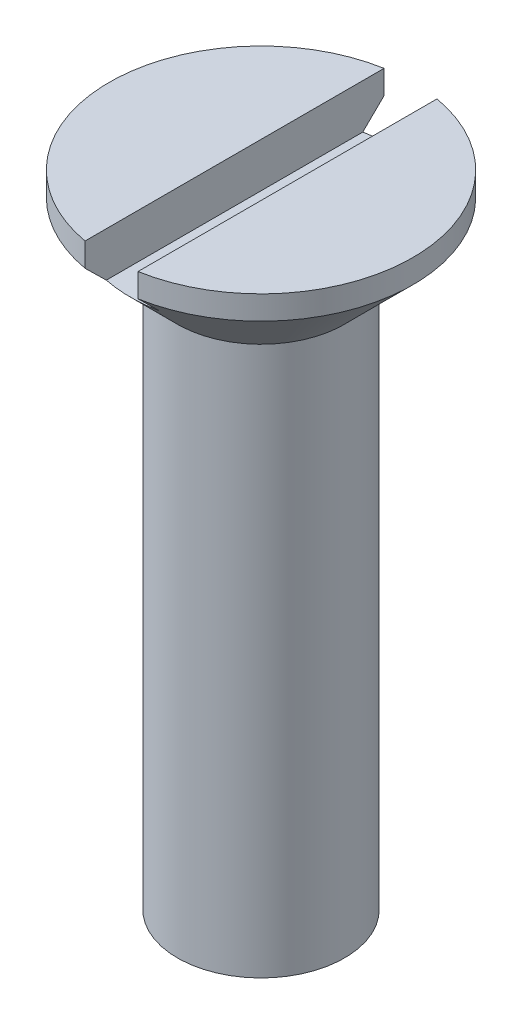
ISO-10303-21;
HEADER;
FILE_DESCRIPTION(('STEP AP214'),'2;1');
FILE_NAME('part.step','',(''),(''),'','','');
FILE_SCHEMA(('AUTOMOTIVE_DESIGN { 1 0 10303 214 1 1 1 1 }'));
ENDSEC;
DATA;
#1=APPLICATION_CONTEXT('core data for automotive mechanical design processes');
#2=APPLICATION_PROTOCOL_DEFINITION('international standard','automotive_design',2000,#1);
#3=PRODUCT_CONTEXT('',#1,'mechanical');
#4=PRODUCT('Part','Part','',(#3));
#5=PRODUCT_RELATED_PRODUCT_CATEGORY('part','',(#4));
#6=PRODUCT_DEFINITION_FORMATION('','',#4);
#7=PRODUCT_DEFINITION_CONTEXT('part definition',#1,'design');
#8=PRODUCT_DEFINITION('design','',#6,#7);
#9=PRODUCT_DEFINITION_SHAPE('','',#8);
#10=(LENGTH_UNIT() NAMED_UNIT(*) SI_UNIT(.MILLI.,.METRE.));
#11=(NAMED_UNIT(*) PLANE_ANGLE_UNIT() SI_UNIT($,.RADIAN.));
#12=(NAMED_UNIT(*) SI_UNIT($,.STERADIAN.) SOLID_ANGLE_UNIT());
#13=UNCERTAINTY_MEASURE_WITH_UNIT(LENGTH_MEASURE(1.E-05),#10,'distance_accuracy_value','');
#14=(GEOMETRIC_REPRESENTATION_CONTEXT(3) GLOBAL_UNCERTAINTY_ASSIGNED_CONTEXT((#13)) GLOBAL_UNIT_ASSIGNED_CONTEXT((#10,
#11,#12)) REPRESENTATION_CONTEXT('',''));
#15=CARTESIAN_POINT('',(0.,0.,0.));
#16=DIRECTION('',(0.,0.,1.));
#17=DIRECTION('',(1.,0.,0.));
#18=AXIS2_PLACEMENT_3D('',#15,#16,#17);
#19=CARTESIAN_POINT('',(0.,24.7320508075689,0.));
#20=DIRECTION('',(0.,1.,0.));
#21=DIRECTION('',(-1.,0.,0.));
#22=AXIS2_PLACEMENT_3D('',#19,#20,#21);
#23=CYLINDRICAL_SURFACE('',#22,5.45);
#24=CARTESIAN_POINT('',(0.,23.882050807569,0.));
#25=DIRECTION('',(0.,1.,0.));
#26=DIRECTION('',(-1.,0.,0.));
#27=AXIS2_PLACEMENT_3D('',#24,#25,#26);
#28=CIRCLE('',#27,5.45);
#29=CARTESIAN_POINT('',(-0.95,23.882050807569,-5.3665631459995));
#30=VERTEX_POINT('',#29);
#31=CARTESIAN_POINT('',(-0.95,23.882050807569,5.3665631459995));
#32=VERTEX_POINT('',#31);
#33=EDGE_CURVE('E104',#30,#32,#28,.T.);
#34=ORIENTED_EDGE('',*,*,#33,.T.);
#35=DIRECTION('',(0.,1.,0.));
#36=VECTOR('',#35,1.);
#37=CARTESIAN_POINT('',(-0.95,24.7320508075689,5.3665631459995));
#38=LINE('',#37,#36);
#39=CARTESIAN_POINT('',(-0.95,24.7320508075689,5.3665631459995));
#40=VERTEX_POINT('',#39);
#41=EDGE_CURVE('E110',#32,#40,#38,.T.);
#42=ORIENTED_EDGE('',*,*,#41,.T.);
#43=CARTESIAN_POINT('',(0.,24.7320508075689,0.));
#44=DIRECTION('',(0.,1.,0.));
#45=DIRECTION('',(-1.,0.,0.));
#46=AXIS2_PLACEMENT_3D('',#43,#44,#45);
#47=CIRCLE('',#46,5.45);
#48=CARTESIAN_POINT('',(-0.95,24.7320508075689,-5.3665631459995));
#49=VERTEX_POINT('',#48);
#50=EDGE_CURVE('E140',#49,#40,#47,.T.);
#51=ORIENTED_EDGE('',*,*,#50,.F.);
#52=DIRECTION('',(0.,1.,0.));
#53=VECTOR('',#52,1.);
#54=CARTESIAN_POINT('',(-0.95,24.7320508075689,-5.3665631459995));
#55=LINE('',#54,#53);
#56=EDGE_CURVE('E48',#49,#30,#55,.F.);
#57=ORIENTED_EDGE('',*,*,#56,.T.);
#58=EDGE_LOOP('',(#34,#42,#51,#57));
#59=FACE_BOUND('',#58,.T.);
#60=ADVANCED_FACE('F33',(#59),#23,.T.);
#61=CARTESIAN_POINT('',(5.45,24.7320508075689,0.));
#62=DIRECTION('',(0.,-1.,0.));
#63=DIRECTION('',(1.,0.,0.));
#64=AXIS2_PLACEMENT_3D('',#61,#62,#63);
#65=PLANE('',#64);
#66=CARTESIAN_POINT('',(0.95,24.7320508075689,5.3665631459995));
#67=VERTEX_POINT('',#66);
#68=CARTESIAN_POINT('',(0.95,24.7320508075689,-5.3665631459995));
#69=VERTEX_POINT('',#68);
#70=EDGE_CURVE('E143',#67,#69,#47,.T.);
#71=ORIENTED_EDGE('',*,*,#70,.T.);
#72=DIRECTION('',(0.,0.,1.));
#73=VECTOR('',#72,1.);
#74=CARTESIAN_POINT('',(0.95,24.7320508075689,0.));
#75=LINE('',#74,#73);
#76=EDGE_CURVE('E153',#69,#67,#75,.T.);
#77=ORIENTED_EDGE('',*,*,#76,.T.);
#78=EDGE_LOOP('',(#71,#77));
#79=FACE_BOUND('',#78,.T.);
#80=ADVANCED_FACE('F167',(#79),#65,.F.);
#81=CARTESIAN_POINT('',(0.,0.,0.));
#82=DIRECTION('',(0.,1.,0.));
#83=DIRECTION('',(-1.,0.,0.));
#84=AXIS2_PLACEMENT_3D('',#81,#82,#83);
#85=CONICAL_SURFACE('',#84,0.,1.04719755119659);
#86=CARTESIAN_POINT('',(0.,1.7320508075689,0.));
#87=DIRECTION('',(0.,1.,0.));
#88=DIRECTION('',(-1.,0.,0.));
#89=AXIS2_PLACEMENT_3D('',#86,#87,#88);
#90=CIRCLE('',#89,3.);
#91=CARTESIAN_POINT('',(-3.,1.7320508075689,0.));
#92=VERTEX_POINT('',#91);
#93=EDGE_CURVE('E149',#92,#92,#90,.T.);
#94=ORIENTED_EDGE('',*,*,#93,.F.);
#95=EDGE_LOOP('',(#94));
#96=FACE_BOUND('',#95,.T.);
#97=CARTESIAN_POINT('',(0.,0.,0.));
#98=VERTEX_POINT('',#97);
#99=VERTEX_LOOP('',#98);
#100=FACE_BOUND('',#99,.T.);
#101=ADVANCED_FACE('F35',(#96,#100),#85,.T.);
#102=CARTESIAN_POINT('',(0.,24.7320508075689,0.));
#103=DIRECTION('',(0.,1.,0.));
#104=DIRECTION('',(-1.,0.,0.));
#105=AXIS2_PLACEMENT_3D('',#102,#103,#104);
#106=CYLINDRICAL_SURFACE('',#105,3.);
#107=CARTESIAN_POINT('',(0.,21.4320508075689,0.));
#108=DIRECTION('',(0.,1.,0.));
#109=DIRECTION('',(-1.,0.,0.));
#110=AXIS2_PLACEMENT_3D('',#107,#108,#109);
#111=CIRCLE('',#110,3.);
#112=CARTESIAN_POINT('',(-3.00000000000001,21.4320508075689,0.));
#113=VERTEX_POINT('',#112);
#114=EDGE_CURVE('E146',#113,#113,#111,.T.);
#115=ORIENTED_EDGE('',*,*,#114,.F.);
#116=EDGE_LOOP('',(#115));
#117=FACE_BOUND('',#116,.T.);
#118=ORIENTED_EDGE('',*,*,#93,.T.);
#119=EDGE_LOOP('',(#118));
#120=FACE_BOUND('',#119,.T.);
#121=ADVANCED_FACE('F189',(#117,#120),#106,.T.);
#122=CARTESIAN_POINT('',(0.,21.4320508075689,0.));
#123=DIRECTION('',(0.,1.,0.));
#124=DIRECTION('',(-1.,0.,0.));
#125=AXIS2_PLACEMENT_3D('',#122,#123,#124);
#126=CONICAL_SURFACE('',#125,3.,0.785398163397435);
#127=CARTESIAN_POINT('',(0.,23.1320508075689,0.));
#128=DIRECTION('',(0.,-1.,0.));
#129=DIRECTION('',(0.,0.,-1.));
#130=AXIS2_PLACEMENT_3D('',#127,#128,#129);
#131=CIRCLE('',#130,4.69999999999996);
#132=CARTESIAN_POINT('',(-0.95,23.1320508075689,-4.60298815988045));
#133=VERTEX_POINT('',#132);
#134=CARTESIAN_POINT('',(0.95,23.1320508075689,-4.60298815988045));
#135=VERTEX_POINT('',#134);
#136=EDGE_CURVE('E11',#133,#135,#131,.T.);
#137=ORIENTED_EDGE('',*,*,#136,.T.);
#138=CARTESIAN_POINT('',(0.95,23.882750807569,5.36727402784691));
#139=CARTESIAN_POINT('',(0.95,23.7386922721518,5.22096942686692));
#140=CARTESIAN_POINT('',(0.95,23.594717816667,5.07458190529039));
#141=CARTESIAN_POINT('',(0.95,23.3068609135357,4.78142879407387));
#142=CARTESIAN_POINT('',(0.95,23.1629787018675,4.63466297275421));
#143=CARTESIAN_POINT('',(0.95,22.8729592168232,4.33821736729773));
#144=CARTESIAN_POINT('',(0.95,22.7268274090927,4.18853223049864));
#145=CARTESIAN_POINT('',(0.95,22.4351467793169,3.88888624809527));
#146=CARTESIAN_POINT('',(0.95,22.2895975209458,3.73892582684176));
#147=CARTESIAN_POINT('',(0.95,21.9161939629479,3.35268732026555));
#148=CARTESIAN_POINT('',(0.95,21.6887724862301,3.11598875256884));
#149=CARTESIAN_POINT('',(0.95,21.3493161636398,2.7584963640041));
#150=CARTESIAN_POINT('',(0.95,21.236233748065,2.63869876965932));
#151=CARTESIAN_POINT('',(0.95,21.0111737581748,2.39816357821469));
#152=CARTESIAN_POINT('',(0.95,20.8991957385827,2.2774263982761));
#153=CARTESIAN_POINT('',(0.95,20.67853218465,2.03630430512404));
#154=CARTESIAN_POINT('',(0.95,20.5698224677065,1.9159416674153));
#155=CARTESIAN_POINT('',(0.95,20.4086407792311,1.73355249406456));
#156=CARTESIAN_POINT('',(0.95,20.3551840995162,1.67239741852466));
#157=CARTESIAN_POINT('',(0.95,20.249165055603,1.54931822073712));
#158=CARTESIAN_POINT('',(0.95,20.1966026596036,1.48739412597212));
#159=CARTESIAN_POINT('',(0.95,20.0930614832441,1.36295298776712));
#160=CARTESIAN_POINT('',(0.95,20.0420742864828,1.30044297031368));
#161=CARTESIAN_POINT('',(0.95,19.9418276633198,1.1740578136491));
#162=CARTESIAN_POINT('',(0.95,19.8925679501324,1.11018290388928));
#163=CARTESIAN_POINT('',(0.95,19.7967350308804,0.980693167144437));
#164=CARTESIAN_POINT('',(0.95,19.7501552486259,0.915083231273168));
#165=CARTESIAN_POINT('',(0.95,19.6609914342475,0.781218199399283));
#166=CARTESIAN_POINT('',(0.950000000000001,19.618403216848,0.712965982498673));
#167=CARTESIAN_POINT('',(0.950000000000001,19.5703966295173,0.627290830226459));
#168=CARTESIAN_POINT('',(0.950000000000001,19.5618340282278,0.61162696887527));
#169=CARTESIAN_POINT('',(0.950000000000001,19.5450800386999,0.580097704625399));
#170=CARTESIAN_POINT('',(0.950000000000001,19.5368887334948,0.564232257651623));
#171=CARTESIAN_POINT('',(0.950000000000001,19.5129403370542,0.516321345769421));
#172=CARTESIAN_POINT('',(0.950000000000001,19.497807251341,0.483958640203413));
#173=CARTESIAN_POINT('',(0.950000000000001,19.4697969259773,0.41866150676453));
#174=CARTESIAN_POINT('',(0.950000000000001,19.4568978648198,0.385736523552193));
#175=CARTESIAN_POINT('',(0.950000000000001,19.4336823191761,0.318972916981205));
#176=CARTESIAN_POINT('',(0.950000000000001,19.423365703705,0.285134340057626));
#177=CARTESIAN_POINT('',(0.950000000000001,19.4076506612621,0.223588326667082));
#178=CARTESIAN_POINT('',(0.950000000000001,19.4016792467842,0.196027953954542));
#179=CARTESIAN_POINT('',(0.950000000000001,19.3919977769264,0.140515145544515));
#180=CARTESIAN_POINT('',(0.950000000000001,19.3882870461112,0.112562829505727));
#181=CARTESIAN_POINT('',(0.950000000000001,19.3833197960642,0.0564821272999003));
#182=CARTESIAN_POINT('',(0.950000000000001,19.3820592916309,0.0283541018134602));
#183=CARTESIAN_POINT('',(0.950000000000001,19.3820423758999,-0.0279054650456303));
#184=CARTESIAN_POINT('',(0.950000000000001,19.3832867874644,-0.0560370045371056));
#185=CARTESIAN_POINT('',(0.950000000000001,19.390696346866,-0.139905474855319));
#186=CARTESIAN_POINT('',(0.950000000000001,19.4005174291714,-0.195353553361738));
#187=CARTESIAN_POINT('',(0.950000000000001,19.4212392064538,-0.276951858970835));
#188=CARTESIAN_POINT('',(0.950000000000001,19.4291644088801,-0.303935870798515));
#189=CARTESIAN_POINT('',(0.950000000000001,19.4467256687551,-0.357345323945067));
#190=CARTESIAN_POINT('',(0.950000000000001,19.456361666027,-0.383770784874257));
#191=CARTESIAN_POINT('',(0.950000000000001,19.4957011628006,-0.483109331771227));
#192=CARTESIAN_POINT('',(0.950000000000001,19.5303028877265,-0.554072842248612));
#193=CARTESIAN_POINT('',(0.950000000000001,19.6061625731116,-0.692377095293818));
#194=CARTESIAN_POINT('',(0.95,19.6474376281942,-0.759707925194157));
#195=CARTESIAN_POINT('',(0.95,19.7343854179115,-0.892236746835574));
#196=CARTESIAN_POINT('',(0.95,19.7800915767685,-0.957412601266742));
#197=CARTESIAN_POINT('',(0.95,19.8505882475632,-1.05366873930186));
#198=CARTESIAN_POINT('',(0.95,19.8743949875734,-1.08548396626276));
#199=CARTESIAN_POINT('',(0.95,19.9225514884079,-1.14870022001966));
#200=CARTESIAN_POINT('',(0.95,19.9469012306484,-1.18010126093252));
#201=CARTESIAN_POINT('',(0.95,20.0273738276732,-1.2823758776928));
#202=CARTESIAN_POINT('',(0.95,20.0844183667243,-1.35252327414217));
#203=CARTESIAN_POINT('',(0.95,20.2000309270026,-1.49155447486903));
#204=CARTESIAN_POINT('',(0.95,20.2585991238413,-1.5604381319182));
#205=CARTESIAN_POINT('',(0.95,20.3768251389196,-1.69730257484181));
#206=CARTESIAN_POINT('',(0.95,20.4364833187202,-1.76528304771245));
#207=CARTESIAN_POINT('',(0.95,20.5565815335222,-1.9005507473882));
#208=CARTESIAN_POINT('',(0.95,20.6170215868318,-1.96783795789346));
#209=CARTESIAN_POINT('',(0.95,20.7993748093158,-2.1690965912153));
#210=CARTESIAN_POINT('',(0.95,20.9221580795635,-2.30227879707853));
#211=CARTESIAN_POINT('',(0.95,21.1690834272461,-2.56731989942214));
#212=CARTESIAN_POINT('',(0.95,21.2932252221135,-2.69917906055035));
#213=CARTESIAN_POINT('',(0.95,21.5418318353516,-2.96141357028882));
#214=CARTESIAN_POINT('',(0.95,21.6662923693899,-3.091792983918));
#215=CARTESIAN_POINT('',(0.95,21.91584203267,-3.35196093172125));
#216=CARTESIAN_POINT('',(0.95,22.0409311942092,-3.48174943486894));
#217=CARTESIAN_POINT('',(0.95,22.4167068941809,-3.87032055879034));
#218=CARTESIAN_POINT('',(0.95,22.6680518604377,-4.12846624524042));
#219=CARTESIAN_POINT('',(0.95,22.9998952872814,-4.46799564927083));
#220=CARTESIAN_POINT('',(0.95,23.0799544519789,-4.54981026078727));
#221=CARTESIAN_POINT('',(0.95,23.2401699023125,-4.7133623083117));
#222=CARTESIAN_POINT('',(0.95,23.3203261977899,-4.79509973468841));
#223=CARTESIAN_POINT('',(0.95,23.4808277419135,-4.95861796157221));
#224=CARTESIAN_POINT('',(0.95,23.5611730969812,-5.04039865757615));
#225=CARTESIAN_POINT('',(0.95,23.7219199630661,-5.20388671182268));
#226=CARTESIAN_POINT('',(0.95,23.8023214667313,-5.28559407729378));
#227=CARTESIAN_POINT('',(0.95,23.882750807569,-5.36727402784691));
#228=B_SPLINE_CURVE_WITH_KNOTS('',3,(#138,#139,#140,#141,#142,#143,#144,#145,#146,#147,#148,
#149,#150,#151,#152,#153,#154,#155,#156,#157,#158,#159,#160,#161,#162,#163,#164,#165,#166,#167,
#168,#169,#170,#171,#172,#173,#174,#175,#176,#177,#178,#179,#180,#181,#182,#183,#184,#185,#186,
#187,#188,#189,#190,#191,#192,#193,#194,#195,#196,#197,#198,#199,#200,#201,#202,#203,#204,#205,
#206,#207,#208,#209,#210,#211,#212,#213,#214,#215,#216,#217,#218,#219,#220,#221,#222,#223,#224,
#225,#226,#227),.UNSPECIFIED.,.F.,.F.,(4,2,2,2,2,2,2,2,2,2,2,2,2,2,2,2,2,2,2,2,2,2,2,2,2,2,2,2,
2,2,2,2,2,2,2,2,2,2,2,2,2,2,2,2,4),(0.,0.615971733476599,1.23255943239415,1.86012628446742,
2.48706670861862,3.47179557281991,3.96600953924991,4.46001535278205,4.94655187034507,
5.190221980699,5.43388340786635,5.67586585560892,5.91780793896078,6.15912850734744,
6.40019314480152,6.45374310913539,6.50730499041664,6.61441955613183,6.72042026818558,
6.82641560266442,6.91093252340636,6.99542418022097,7.0797782991521,7.16416013283661,
7.33221931503607,7.41655133425572,7.50088038770466,7.73701700389003,7.97376838906792,
8.2124699573646,8.33167593620546,8.45087784155267,8.72208373607486,8.99332102854818,
9.26464998888773,9.53598531416882,10.0793982088177,10.6227001465017,11.163439887313,
11.7042077001588,12.7850905081249,13.12849691219,13.4719416386939,13.8158763771414,
14.1597723411596),.UNSPECIFIED.);
#229=CARTESIAN_POINT('',(0.95,23.882050807569,-5.3665631459995));
#230=VERTEX_POINT('',#229);
#231=EDGE_CURVE('E133',#135,#230,#228,.T.);
#232=ORIENTED_EDGE('',*,*,#231,.T.);
#233=CARTESIAN_POINT('',(0.95,23.882050807569,5.3665631459995));
#234=VERTEX_POINT('',#233);
#235=EDGE_CURVE('E145',#234,#230,#28,.T.);
#236=ORIENTED_EDGE('',*,*,#235,.F.);
#237=CARTESIAN_POINT('',(0.95,23.1320508075689,4.60298815988045));
#238=VERTEX_POINT('',#237);
#239=EDGE_CURVE('E139',#234,#238,#228,.T.);
#240=ORIENTED_EDGE('',*,*,#239,.T.);
#241=CARTESIAN_POINT('',(-0.95,23.1320508075689,4.60298815988045));
#242=VERTEX_POINT('',#241);
#243=EDGE_CURVE('E37',#238,#242,#131,.T.);
#244=ORIENTED_EDGE('',*,*,#243,.T.);
#245=CARTESIAN_POINT('',(-0.95,23.882750807569,-5.36727402784691));
#246=CARTESIAN_POINT('',(-0.95,23.7386922721518,-5.22096942686692));
#247=CARTESIAN_POINT('',(-0.95,23.594717816667,-5.07458190529039));
#248=CARTESIAN_POINT('',(-0.95,23.3068609135357,-4.78142879407388));
#249=CARTESIAN_POINT('',(-0.95,23.1629787018675,-4.63466297275422));
#250=CARTESIAN_POINT('',(-0.95,22.8729592168232,-4.33821736729775));
#251=CARTESIAN_POINT('',(-0.950000000000001,22.7268274090928,-4.18853223049867));
#252=CARTESIAN_POINT('',(-0.950000000000001,22.435146779317,-3.88888624809531));
#253=CARTESIAN_POINT('',(-0.950000000000001,22.2895975209458,-3.7389258268418));
#254=CARTESIAN_POINT('',(-0.950000000000001,21.916193962948,-3.35268732026559));
#255=CARTESIAN_POINT('',(-0.950000000000001,21.6887724862301,-3.11598875256887));
#256=CARTESIAN_POINT('',(-0.950000000000001,21.3493161636398,-2.75849636400413));
#257=CARTESIAN_POINT('',(-0.950000000000001,21.236233748065,-2.63869876965935));
#258=CARTESIAN_POINT('',(-0.950000000000001,21.0111737581749,-2.39816357821471));
#259=CARTESIAN_POINT('',(-0.950000000000001,20.8991957385827,-2.27742639827612));
#260=CARTESIAN_POINT('',(-0.950000000000001,20.67853218465,-2.03630430512406));
#261=CARTESIAN_POINT('',(-0.950000000000001,20.5698224677066,-1.91594166741532));
#262=CARTESIAN_POINT('',(-0.950000000000001,20.4086407792311,-1.73355249406457));
#263=CARTESIAN_POINT('',(-0.950000000000001,20.3551840995162,-1.67239741852468));
#264=CARTESIAN_POINT('',(-0.950000000000001,20.249165055603,-1.54931822073713));
#265=CARTESIAN_POINT('',(-0.950000000000001,20.1966026596036,-1.48739412597213));
#266=CARTESIAN_POINT('',(-0.950000000000001,20.0930614832441,-1.36295298776713));
#267=CARTESIAN_POINT('',(-0.950000000000001,20.0420742864828,-1.30044297031369));
#268=CARTESIAN_POINT('',(-0.950000000000001,19.9418276633198,-1.17405781364911));
#269=CARTESIAN_POINT('',(-0.950000000000001,19.8925679501324,-1.11018290388928));
#270=CARTESIAN_POINT('',(-0.950000000000001,19.7967350308804,-0.980693167144441));
#271=CARTESIAN_POINT('',(-0.950000000000001,19.7501552486259,-0.91508323127317));
#272=CARTESIAN_POINT('',(-0.950000000000001,19.6609914342475,-0.781218199399284));
#273=CARTESIAN_POINT('',(-0.950000000000001,19.618403216848,-0.712965982498674));
#274=CARTESIAN_POINT('',(-0.950000000000001,19.5703966295173,-0.627290830226458));
#275=CARTESIAN_POINT('',(-0.950000000000001,19.5618340282278,-0.611626968875268));
#276=CARTESIAN_POINT('',(-0.950000000000001,19.5450800386999,-0.580097704625397));
#277=CARTESIAN_POINT('',(-0.950000000000001,19.5368887334948,-0.564232257651621));
#278=CARTESIAN_POINT('',(-0.950000000000001,19.5129403370542,-0.51632134576942));
#279=CARTESIAN_POINT('',(-0.950000000000001,19.497807251341,-0.48395864020341));
#280=CARTESIAN_POINT('',(-0.950000000000001,19.4697969259773,-0.418661506764527));
#281=CARTESIAN_POINT('',(-0.950000000000001,19.4568978648198,-0.38573652355219));
#282=CARTESIAN_POINT('',(-0.950000000000001,19.4336823191761,-0.318972916981203));
#283=CARTESIAN_POINT('',(-0.950000000000001,19.423365703705,-0.285134340057624));
#284=CARTESIAN_POINT('',(-0.950000000000001,19.4076506612621,-0.223588326667081));
#285=CARTESIAN_POINT('',(-0.950000000000001,19.4016792467842,-0.19602795395454));
#286=CARTESIAN_POINT('',(-0.950000000000001,19.3919977769264,-0.140515145544513));
#287=CARTESIAN_POINT('',(-0.950000000000001,19.3882870461112,-0.112562829505725));
#288=CARTESIAN_POINT('',(-0.950000000000001,19.3833197960642,-0.0564821272998991));
#289=CARTESIAN_POINT('',(-0.950000000000001,19.3820592916308,-0.0283541018134593));
#290=CARTESIAN_POINT('',(-0.950000000000001,19.3820423758999,0.0279054650456308));
#291=CARTESIAN_POINT('',(-0.950000000000001,19.3832867874644,0.0560370045371061));
#292=CARTESIAN_POINT('',(-0.950000000000001,19.390696346866,0.13990547485532));
#293=CARTESIAN_POINT('',(-0.950000000000001,19.4005174291714,0.195353553361739));
#294=CARTESIAN_POINT('',(-0.950000000000001,19.4212392064538,0.276951858970836));
#295=CARTESIAN_POINT('',(-0.950000000000001,19.4291644088801,0.303935870798516));
#296=CARTESIAN_POINT('',(-0.950000000000001,19.4467256687551,0.357345323945067));
#297=CARTESIAN_POINT('',(-0.950000000000001,19.456361666027,0.383770784874257));
#298=CARTESIAN_POINT('',(-0.950000000000001,19.4957011628006,0.483109331771227));
#299=CARTESIAN_POINT('',(-0.950000000000001,19.5303028877265,0.554072842248612));
#300=CARTESIAN_POINT('',(-0.950000000000001,19.6061625731116,0.692377095293819));
#301=CARTESIAN_POINT('',(-0.950000000000001,19.6474376281942,0.759707925194158));
#302=CARTESIAN_POINT('',(-0.950000000000001,19.7343854179115,0.892236746835576));
#303=CARTESIAN_POINT('',(-0.950000000000001,19.7800915767685,0.957412601266745));
#304=CARTESIAN_POINT('',(-0.950000000000001,19.8505882475632,1.05366873930186));
#305=CARTESIAN_POINT('',(-0.950000000000001,19.8743949875734,1.08548396626276));
#306=CARTESIAN_POINT('',(-0.950000000000001,19.9225514884079,1.14870022001966));
#307=CARTESIAN_POINT('',(-0.950000000000001,19.9469012306484,1.18010126093252));
#308=CARTESIAN_POINT('',(-0.950000000000001,20.0273738276732,1.2823758776928));
#309=CARTESIAN_POINT('',(-0.950000000000001,20.0844183667243,1.35252327414217));
#310=CARTESIAN_POINT('',(-0.950000000000001,20.2000309270026,1.49155447486904));
#311=CARTESIAN_POINT('',(-0.950000000000001,20.2585991238413,1.5604381319182));
#312=CARTESIAN_POINT('',(-0.950000000000001,20.3768251389196,1.69730257484181));
#313=CARTESIAN_POINT('',(-0.950000000000001,20.4364833187202,1.76528304771245));
#314=CARTESIAN_POINT('',(-0.950000000000001,20.5565815335222,1.9005507473882));
#315=CARTESIAN_POINT('',(-0.950000000000001,20.6170215868318,1.96783795789347));
#316=CARTESIAN_POINT('',(-0.950000000000001,20.7993748093158,2.16909659121531));
#317=CARTESIAN_POINT('',(-0.950000000000001,20.9221580795635,2.30227879707853));
#318=CARTESIAN_POINT('',(-0.950000000000001,21.1690834272461,2.56731989942214));
#319=CARTESIAN_POINT('',(-0.950000000000001,21.2932252221135,2.69917906055036));
#320=CARTESIAN_POINT('',(-0.950000000000001,21.5418318353516,2.96141357028882));
#321=CARTESIAN_POINT('',(-0.950000000000001,21.6662923693899,3.091792983918));
#322=CARTESIAN_POINT('',(-0.950000000000001,21.91584203267,3.35196093172125));
#323=CARTESIAN_POINT('',(-0.950000000000001,22.0409311942092,3.48174943486895));
#324=CARTESIAN_POINT('',(-0.950000000000001,22.4167068941809,3.87032055879034));
#325=CARTESIAN_POINT('',(-0.950000000000001,22.6680518604377,4.12846624524042));
#326=CARTESIAN_POINT('',(-0.950000000000001,22.9998952872814,4.46799564927083));
#327=CARTESIAN_POINT('',(-0.95,23.0799544519789,4.54981026078727));
#328=CARTESIAN_POINT('',(-0.95,23.2401699023126,4.7133623083117));
#329=CARTESIAN_POINT('',(-0.95,23.3203261977899,4.79509973468841));
#330=CARTESIAN_POINT('',(-0.95,23.4808277419135,4.95861796157221));
#331=CARTESIAN_POINT('',(-0.95,23.5611730969812,5.04039865757615));
#332=CARTESIAN_POINT('',(-0.95,23.7219199630661,5.20388671182268));
#333=CARTESIAN_POINT('',(-0.95,23.8023214667313,5.28559407729378));
#334=CARTESIAN_POINT('',(-0.95,23.882750807569,5.36727402784691));
#335=B_SPLINE_CURVE_WITH_KNOTS('',3,(#245,#246,#247,#248,#249,#250,#251,#252,#253,#254,#255,
#256,#257,#258,#259,#260,#261,#262,#263,#264,#265,#266,#267,#268,#269,#270,#271,#272,#273,#274,
#275,#276,#277,#278,#279,#280,#281,#282,#283,#284,#285,#286,#287,#288,#289,#290,#291,#292,#293,
#294,#295,#296,#297,#298,#299,#300,#301,#302,#303,#304,#305,#306,#307,#308,#309,#310,#311,#312,
#313,#314,#315,#316,#317,#318,#319,#320,#321,#322,#323,#324,#325,#326,#327,#328,#329,#330,#331,
#332,#333,#334),.UNSPECIFIED.,.F.,.F.,(4,2,2,2,2,2,2,2,2,2,2,2,2,2,2,2,2,2,2,2,2,2,2,2,2,2,2,2,
2,2,2,2,2,2,2,2,2,2,2,2,2,2,2,2,4),(0.,0.615971733476589,1.23255943239412,1.86012628446738,
2.48706670861856,3.47179557281986,3.96600953924988,4.46001535278202,4.94655187034505,
5.19022198069899,5.43388340786634,5.67586585560891,5.91780793896077,6.15912850734744,
6.40019314480152,6.45374310913539,6.50730499041664,6.61441955613184,6.72042026818558,
6.82641560266443,6.91093252340636,6.99542418022098,7.0797782991521,7.16416013283661,
7.33221931503607,7.41655133425573,7.50088038770466,7.73701700389003,7.97376838906792,
8.21246995736461,8.33167593620546,8.45087784155268,8.72208373607486,8.99332102854818,
9.26464998888774,9.53598531416883,10.0793982088177,10.6227001465017,11.163439887313,
11.7042077001588,12.7850905081249,13.12849691219,13.4719416386939,13.8158763771414,
14.1597723411596),.UNSPECIFIED.);
#336=EDGE_CURVE('E98',#242,#32,#335,.T.);
#337=ORIENTED_EDGE('',*,*,#336,.T.);
#338=ORIENTED_EDGE('',*,*,#33,.F.);
#339=EDGE_CURVE('E96',#30,#133,#335,.T.);
#340=ORIENTED_EDGE('',*,*,#339,.T.);
#341=EDGE_LOOP('',(#137,#232,#236,#240,#244,#337,#338,#340));
#342=FACE_BOUND('',#341,.T.);
#343=ORIENTED_EDGE('',*,*,#114,.T.);
#344=EDGE_LOOP('',(#343));
#345=FACE_BOUND('',#344,.T.);
#346=ADVANCED_FACE('F101',(#342,#345),#126,.T.);
#347=ORIENTED_EDGE('',*,*,#235,.T.);
#348=DIRECTION('',(0.,1.,0.));
#349=VECTOR('',#348,1.);
#350=CARTESIAN_POINT('',(0.95,24.7320508075689,-5.3665631459995));
#351=LINE('',#350,#349);
#352=EDGE_CURVE('E108',#230,#69,#351,.T.);
#353=ORIENTED_EDGE('',*,*,#352,.T.);
#354=ORIENTED_EDGE('',*,*,#70,.F.);
#355=DIRECTION('',(0.,1.,0.));
#356=VECTOR('',#355,1.);
#357=CARTESIAN_POINT('',(0.95,24.7320508075689,5.3665631459995));
#358=LINE('',#357,#356);
#359=EDGE_CURVE('E105',#67,#234,#358,.F.);
#360=ORIENTED_EDGE('',*,*,#359,.T.);
#361=EDGE_LOOP('',(#347,#353,#354,#360));
#362=FACE_BOUND('',#361,.T.);
#363=ADVANCED_FACE('F166',(#362),#23,.T.);
#364=ORIENTED_EDGE('',*,*,#50,.T.);
#365=DIRECTION('',(0.,0.,-1.));
#366=VECTOR('',#365,1.);
#367=CARTESIAN_POINT('',(-0.95,24.7320508075689,0.));
#368=LINE('',#367,#366);
#369=EDGE_CURVE('E152',#40,#49,#368,.T.);
#370=ORIENTED_EDGE('',*,*,#369,.T.);
#371=EDGE_LOOP('',(#364,#370));
#372=FACE_BOUND('',#371,.T.);
#373=ADVANCED_FACE('F131',(#372),#65,.F.);
#374=CARTESIAN_POINT('',(-0.95,23.1320508075689,-5.45));
#375=DIRECTION('',(0.,-1.,0.));
#376=DIRECTION('',(0.,0.,-1.));
#377=AXIS2_PLACEMENT_3D('',#374,#375,#376);
#378=PLANE('',#377);
#379=DIRECTION('',(0.,0.,1.));
#380=VECTOR('',#379,1.);
#381=CARTESIAN_POINT('',(0.95,23.1320508075689,-5.45));
#382=LINE('',#381,#380);
#383=EDGE_CURVE('E91',#135,#238,#382,.T.);
#384=ORIENTED_EDGE('',*,*,#383,.F.);
#385=ORIENTED_EDGE('',*,*,#136,.F.);
#386=DIRECTION('',(0.,0.,1.));
#387=VECTOR('',#386,1.);
#388=CARTESIAN_POINT('',(-0.95,23.1320508075689,-5.45));
#389=LINE('',#388,#387);
#390=EDGE_CURVE('E88',#133,#242,#389,.T.);
#391=ORIENTED_EDGE('',*,*,#390,.T.);
#392=ORIENTED_EDGE('',*,*,#243,.F.);
#393=EDGE_LOOP('',(#384,#385,#391,#392));
#394=FACE_BOUND('',#393,.T.);
#395=ADVANCED_FACE('F87',(#394),#378,.F.);
#396=CARTESIAN_POINT('',(0.949999999999999,26.3320508075689,-5.45));
#397=DIRECTION('',(1.,0.,0.));
#398=DIRECTION('',(0.,1.,0.));
#399=AXIS2_PLACEMENT_3D('',#396,#397,#398);
#400=PLANE('',#399);
#401=ORIENTED_EDGE('',*,*,#359,.F.);
#402=ORIENTED_EDGE('',*,*,#76,.F.);
#403=ORIENTED_EDGE('',*,*,#352,.F.);
#404=ORIENTED_EDGE('',*,*,#231,.F.);
#405=ORIENTED_EDGE('',*,*,#383,.T.);
#406=ORIENTED_EDGE('',*,*,#239,.F.);
#407=EDGE_LOOP('',(#401,#402,#403,#404,#405,#406));
#408=FACE_BOUND('',#407,.T.);
#409=ADVANCED_FACE('F126',(#408),#400,.F.);
#410=CARTESIAN_POINT('',(-0.95,26.3320508075689,-5.45));
#411=DIRECTION('',(-1.,0.,0.));
#412=DIRECTION('',(0.,-1.,0.));
#413=AXIS2_PLACEMENT_3D('',#410,#411,#412);
#414=PLANE('',#413);
#415=ORIENTED_EDGE('',*,*,#56,.F.);
#416=ORIENTED_EDGE('',*,*,#369,.F.);
#417=ORIENTED_EDGE('',*,*,#41,.F.);
#418=ORIENTED_EDGE('',*,*,#336,.F.);
#419=ORIENTED_EDGE('',*,*,#390,.F.);
#420=ORIENTED_EDGE('',*,*,#339,.F.);
#421=EDGE_LOOP('',(#415,#416,#417,#418,#419,#420));
#422=FACE_BOUND('',#421,.T.);
#423=ADVANCED_FACE('F95',(#422),#414,.F.);
#424=CLOSED_SHELL('',(#60,#80,#101,#121,#346,#363,#373,#395,#409,#423));
#425=MANIFOLD_SOLID_BREP('B2',#424);
#426=ADVANCED_BREP_SHAPE_REPRESENTATION('',(#18,#425),#14);
#427=SHAPE_DEFINITION_REPRESENTATION(#9,#426);
ENDSEC;
END-ISO-10303-21;
